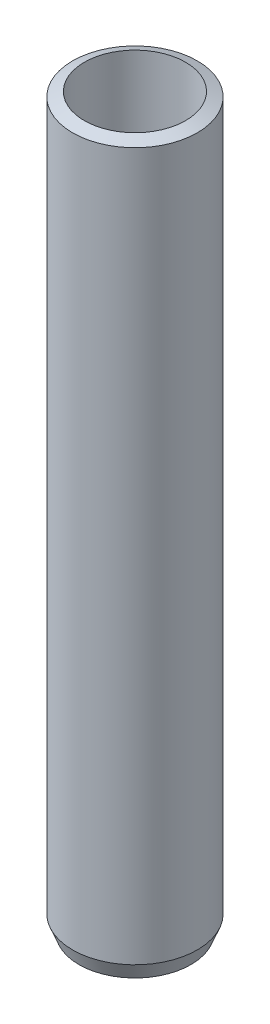
ISO-10303-21;
HEADER;
FILE_DESCRIPTION(('STEP AP214'),'2;1');
FILE_NAME('part.step','',(''),(''),'','','');
FILE_SCHEMA(('AUTOMOTIVE_DESIGN { 1 0 10303 214 1 1 1 1 }'));
ENDSEC;
DATA;
#1=APPLICATION_CONTEXT('core data for automotive mechanical design processes');
#2=APPLICATION_PROTOCOL_DEFINITION('international standard','automotive_design',2000,#1);
#3=PRODUCT_CONTEXT('',#1,'mechanical');
#4=PRODUCT('Part','Part','',(#3));
#5=PRODUCT_RELATED_PRODUCT_CATEGORY('part','',(#4));
#6=PRODUCT_DEFINITION_FORMATION('','',#4);
#7=PRODUCT_DEFINITION_CONTEXT('part definition',#1,'design');
#8=PRODUCT_DEFINITION('design','',#6,#7);
#9=PRODUCT_DEFINITION_SHAPE('','',#8);
#10=(LENGTH_UNIT() NAMED_UNIT(*) SI_UNIT(.MILLI.,.METRE.));
#11=(NAMED_UNIT(*) PLANE_ANGLE_UNIT() SI_UNIT($,.RADIAN.));
#12=(NAMED_UNIT(*) SI_UNIT($,.STERADIAN.) SOLID_ANGLE_UNIT());
#13=UNCERTAINTY_MEASURE_WITH_UNIT(LENGTH_MEASURE(1.E-05),#10,'distance_accuracy_value','');
#14=(GEOMETRIC_REPRESENTATION_CONTEXT(3) GLOBAL_UNCERTAINTY_ASSIGNED_CONTEXT((#13)) GLOBAL_UNIT_ASSIGNED_CONTEXT((#10,
#11,#12)) REPRESENTATION_CONTEXT('',''));
#15=CARTESIAN_POINT('',(0.,0.,0.));
#16=DIRECTION('',(0.,0.,1.));
#17=DIRECTION('',(1.,0.,0.));
#18=AXIS2_PLACEMENT_3D('',#15,#16,#17);
#19=CARTESIAN_POINT('',(0.,380.445132607666,0.));
#20=DIRECTION('',(0.,-1.,0.));
#21=DIRECTION('',(0.,0.,-1.));
#22=AXIS2_PLACEMENT_3D('',#19,#20,#21);
#23=CYLINDRICAL_SURFACE('',#22,32.5);
#24=CARTESIAN_POINT('',(0.,377.139196120683,0.));
#25=DIRECTION('',(0.,1.,0.));
#26=DIRECTION('',(0.,0.,1.));
#27=AXIS2_PLACEMENT_3D('',#24,#25,#26);
#28=CIRCLE('',#27,32.5);
#29=CARTESIAN_POINT('',(0.,377.139196120683,32.5));
#30=VERTEX_POINT('',#29);
#31=EDGE_CURVE('E50',#30,#30,#28,.F.);
#32=ORIENTED_EDGE('',*,*,#31,.T.);
#33=EDGE_LOOP('',(#32));
#34=FACE_BOUND('',#33,.T.);
#35=CARTESIAN_POINT('',(0.,8.29880380864767,0.));
#36=DIRECTION('',(0.,1.,0.));
#37=DIRECTION('',(0.,0.,1.));
#38=AXIS2_PLACEMENT_3D('',#35,#36,#37);
#39=CIRCLE('',#38,32.5);
#40=CARTESIAN_POINT('',(0.,8.29880380864767,32.5));
#41=VERTEX_POINT('',#40);
#42=EDGE_CURVE('E51',#41,#41,#39,.T.);
#43=ORIENTED_EDGE('',*,*,#42,.T.);
#44=EDGE_LOOP('',(#43));
#45=FACE_BOUND('',#44,.T.);
#46=ADVANCED_FACE('F39',(#34,#45),#23,.T.);
#47=CARTESIAN_POINT('',(0.,0.,0.));
#48=DIRECTION('',(0.,1.,0.));
#49=DIRECTION('',(0.,0.,1.));
#50=AXIS2_PLACEMENT_3D('',#47,#48,#49);
#51=PLANE('',#50);
#52=CARTESIAN_POINT('',(0.,0.,0.));
#53=DIRECTION('',(0.,1.,0.));
#54=DIRECTION('',(0.,0.,1.));
#55=AXIS2_PLACEMENT_3D('',#52,#53,#54);
#56=CIRCLE('',#55,29.1940635130166);
#57=CARTESIAN_POINT('',(0.,0.,29.1940635130166));
#58=VERTEX_POINT('',#57);
#59=EDGE_CURVE('E10',#58,#58,#56,.F.);
#60=ORIENTED_EDGE('',*,*,#59,.T.);
#61=EDGE_LOOP('',(#60));
#62=FACE_BOUND('',#61,.T.);
#63=CARTESIAN_POINT('',(0.,0.,0.));
#64=DIRECTION('',(0.,1.,0.));
#65=DIRECTION('',(0.,0.,1.));
#66=AXIS2_PLACEMENT_3D('',#63,#64,#65);
#67=CIRCLE('',#66,26.387532092404);
#68=CARTESIAN_POINT('',(0.,0.,26.387532092404));
#69=VERTEX_POINT('',#68);
#70=EDGE_CURVE('E58',#69,#69,#67,.T.);
#71=ORIENTED_EDGE('',*,*,#70,.T.);
#72=EDGE_LOOP('',(#71));
#73=FACE_BOUND('',#72,.T.);
#74=ADVANCED_FACE('F62',(#62,#73),#51,.F.);
#75=CARTESIAN_POINT('',(0.,380.445132607666,0.));
#76=DIRECTION('',(0.,-1.,0.));
#77=DIRECTION('',(0.,0.,-1.));
#78=AXIS2_PLACEMENT_3D('',#75,#76,#77);
#79=CYLINDRICAL_SURFACE('',#78,26.387532092404);
#80=CARTESIAN_POINT('',(0.,379.574177251358,0.));
#81=DIRECTION('',(0.,-1.,0.));
#82=DIRECTION('',(0.,0.,-1.));
#83=AXIS2_PLACEMENT_3D('',#80,#81,#82);
#84=CIRCLE('',#83,26.387532092404);
#85=CARTESIAN_POINT('',(0.,379.574177251358,-26.387532092404));
#86=VERTEX_POINT('',#85);
#87=EDGE_CURVE('E54',#86,#86,#84,.F.);
#88=ORIENTED_EDGE('',*,*,#87,.T.);
#89=EDGE_LOOP('',(#88));
#90=FACE_BOUND('',#89,.T.);
#91=ORIENTED_EDGE('',*,*,#70,.F.);
#92=EDGE_LOOP('',(#91));
#93=FACE_BOUND('',#92,.T.);
#94=ADVANCED_FACE('F68',(#90,#93),#79,.F.);
#95=CARTESIAN_POINT('',(0.,380.445132607666,0.));
#96=DIRECTION('',(0.,-1.,0.));
#97=DIRECTION('',(0.,0.,-1.));
#98=AXIS2_PLACEMENT_3D('',#95,#96,#97);
#99=CONICAL_SURFACE('',#98,24.2011961913519,1.19170194173567);
#100=ORIENTED_EDGE('',*,*,#31,.F.);
#101=EDGE_LOOP('',(#100));
#102=FACE_BOUND('',#101,.T.);
#103=ORIENTED_EDGE('',*,*,#87,.F.);
#104=EDGE_LOOP('',(#103));
#105=FACE_BOUND('',#104,.T.);
#106=ADVANCED_FACE('F66',(#102,#105),#99,.T.);
#107=CARTESIAN_POINT('',(0.,8.29880380864767,0.));
#108=DIRECTION('',(0.,1.,0.));
#109=DIRECTION('',(0.,0.,1.));
#110=AXIS2_PLACEMENT_3D('',#107,#108,#109);
#111=CONICAL_SURFACE('',#110,32.5,0.37909438505923);
#112=ORIENTED_EDGE('',*,*,#59,.F.);
#113=EDGE_LOOP('',(#112));
#114=FACE_BOUND('',#113,.T.);
#115=ORIENTED_EDGE('',*,*,#42,.F.);
#116=EDGE_LOOP('',(#115));
#117=FACE_BOUND('',#116,.T.);
#118=ADVANCED_FACE('F45',(#114,#117),#111,.T.);
#119=CLOSED_SHELL('',(#46,#74,#94,#106,#118));
#120=MANIFOLD_SOLID_BREP('B2',#119);
#121=ADVANCED_BREP_SHAPE_REPRESENTATION('',(#18,#120),#14);
#122=SHAPE_DEFINITION_REPRESENTATION(#9,#121);
ENDSEC;
END-ISO-10303-21;
